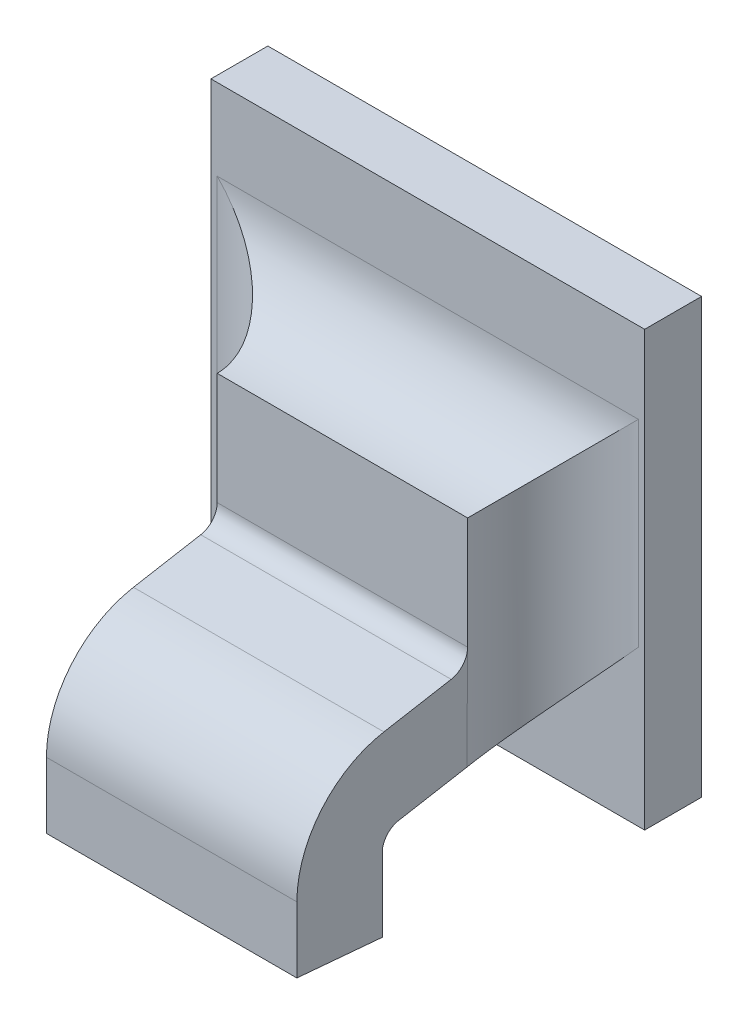
ISO-10303-21;
HEADER;
FILE_DESCRIPTION(('STEP AP214'),'2;1');
FILE_NAME('part.step','',(''),(''),'','','');
FILE_SCHEMA(('AUTOMOTIVE_DESIGN { 1 0 10303 214 1 1 1 1 }'));
ENDSEC;
DATA;
#1=APPLICATION_CONTEXT('core data for automotive mechanical design processes');
#2=APPLICATION_PROTOCOL_DEFINITION('international standard','automotive_design',2000,#1);
#3=PRODUCT_CONTEXT('',#1,'mechanical');
#4=PRODUCT('Part','Part','',(#3));
#5=PRODUCT_RELATED_PRODUCT_CATEGORY('part','',(#4));
#6=PRODUCT_DEFINITION_FORMATION('','',#4);
#7=PRODUCT_DEFINITION_CONTEXT('part definition',#1,'design');
#8=PRODUCT_DEFINITION('design','',#6,#7);
#9=PRODUCT_DEFINITION_SHAPE('','',#8);
#10=(LENGTH_UNIT() NAMED_UNIT(*) SI_UNIT(.MILLI.,.METRE.));
#11=(NAMED_UNIT(*) PLANE_ANGLE_UNIT() SI_UNIT($,.RADIAN.));
#12=(NAMED_UNIT(*) SI_UNIT($,.STERADIAN.) SOLID_ANGLE_UNIT());
#13=UNCERTAINTY_MEASURE_WITH_UNIT(LENGTH_MEASURE(1.E-05),#10,'distance_accuracy_value','');
#14=(GEOMETRIC_REPRESENTATION_CONTEXT(3) GLOBAL_UNCERTAINTY_ASSIGNED_CONTEXT((#13)) GLOBAL_UNIT_ASSIGNED_CONTEXT((#10,
#11,#12)) REPRESENTATION_CONTEXT('',''));
#15=CARTESIAN_POINT('',(0.,0.,0.));
#16=DIRECTION('',(0.,0.,1.));
#17=DIRECTION('',(1.,0.,0.));
#18=AXIS2_PLACEMENT_3D('',#15,#16,#17);
#19=CARTESIAN_POINT('',(0.128135864697779,-0.410007957948562,0.0757120583538573));
#20=DIRECTION('',(0.,0.984807753012208,0.17364817766693));
#21=DIRECTION('',(0.,-0.17364817766693,0.984807753012208));
#22=AXIS2_PLACEMENT_3D('',#19,#20,#21);
#23=PLANE('',#22);
#24=DIRECTION('',(0.,-0.1736481776669,0.984807753012213));
#25=VECTOR('',#24,1.);
#26=CARTESIAN_POINT('',(0.146324841075731,-0.410048986112752,0.0759447406355241));
#27=LINE('',#26,#25);
#28=CARTESIAN_POINT('',(0.146324841075731,-0.410048986112752,0.0759447406355241));
#29=VERTEX_POINT('',#28);
#30=CARTESIAN_POINT('',(0.146324841075731,-0.410869549396565,0.0805983862688596));
#31=VERTEX_POINT('',#30);
#32=EDGE_CURVE('E149',#29,#31,#27,.T.);
#33=ORIENTED_EDGE('',*,*,#32,.F.);
#34=DIRECTION('',(1.,0.,0.));
#35=VECTOR('',#34,1.);
#36=CARTESIAN_POINT('',(0.147190982808015,-0.410048986112752,0.075944740635524));
#37=LINE('',#36,#35);
#38=CARTESIAN_POINT('',(0.129002006430062,-0.410048986112752,0.0759447406355241));
#39=VERTEX_POINT('',#38);
#40=EDGE_CURVE('E145',#29,#39,#37,.F.);
#41=ORIENTED_EDGE('',*,*,#40,.T.);
#42=DIRECTION('',(0.,-0.1736481776669,0.984807753012213));
#43=VECTOR('',#42,1.);
#44=CARTESIAN_POINT('',(0.129002006430062,-0.410048986112752,0.0759447406355241));
#45=LINE('',#44,#43);
#46=CARTESIAN_POINT('',(0.129002006430062,-0.410869549396565,0.0805983862688596));
#47=VERTEX_POINT('',#46);
#48=EDGE_CURVE('E187',#39,#47,#45,.T.);
#49=ORIENTED_EDGE('',*,*,#48,.T.);
#50=DIRECTION('',(1.,0.,0.));
#51=VECTOR('',#50,1.);
#52=CARTESIAN_POINT('',(0.147190982808015,-0.410869549396566,0.0805983862688596));
#53=LINE('',#52,#51);
#54=EDGE_CURVE('E228',#31,#47,#53,.F.);
#55=ORIENTED_EDGE('',*,*,#54,.F.);
#56=EDGE_LOOP('',(#33,#41,#49,#55));
#57=FACE_BOUND('',#56,.T.);
#58=ADVANCED_FACE('F17',(#57),#23,.T.);
#59=CARTESIAN_POINT('',(0.147190982808015,-0.418042361770867,0.0793336259197108));
#60=DIRECTION('',(1.,0.,0.));
#61=DIRECTION('',(0.,1.,0.));
#62=AXIS2_PLACEMENT_3D('',#59,#60,#61);
#63=CYLINDRICAL_SURFACE('',#62,0.00728346456692914);
#64=CARTESIAN_POINT('',(0.146324841075731,-0.418042361770867,0.0793336259197108));
#65=DIRECTION('',(1.,0.,0.));
#66=DIRECTION('',(0.,1.,0.));
#67=AXIS2_PLACEMENT_3D('',#64,#65,#66);
#68=CIRCLE('',#67,0.00728346456692914);
#69=CARTESIAN_POINT('',(0.146324841075731,-0.418042361770867,0.0866170904866399));
#70=VERTEX_POINT('',#69);
#71=EDGE_CURVE('E202',#31,#70,#68,.T.);
#72=ORIENTED_EDGE('',*,*,#71,.F.);
#73=ORIENTED_EDGE('',*,*,#54,.T.);
#74=CARTESIAN_POINT('',(0.129002006430062,-0.418042361770867,0.0793336259197108));
#75=DIRECTION('',(1.,0.,0.));
#76=DIRECTION('',(0.,1.,0.));
#77=AXIS2_PLACEMENT_3D('',#74,#75,#76);
#78=CIRCLE('',#77,0.00728346456692914);
#79=CARTESIAN_POINT('',(0.129002006430062,-0.418042361770867,0.0866170904866399));
#80=VERTEX_POINT('',#79);
#81=EDGE_CURVE('E184',#47,#80,#78,.T.);
#82=ORIENTED_EDGE('',*,*,#81,.T.);
#83=DIRECTION('',(1.,0.,0.));
#84=VECTOR('',#83,1.);
#85=CARTESIAN_POINT('',(0.128135864697779,-0.418042361770867,0.0866170904866399));
#86=LINE('',#85,#84);
#87=EDGE_CURVE('E224',#70,#80,#86,.F.);
#88=ORIENTED_EDGE('',*,*,#87,.F.);
#89=EDGE_LOOP('',(#72,#73,#82,#88));
#90=FACE_BOUND('',#89,.T.);
#91=ADVANCED_FACE('F278',(#90),#63,.T.);
#92=CARTESIAN_POINT('',(0.128135864697779,-0.417814352243781,0.0866170904866399));
#93=DIRECTION('',(0.,0.,1.));
#94=DIRECTION('',(0.,-1.,0.));
#95=AXIS2_PLACEMENT_3D('',#92,#93,#94);
#96=PLANE('',#95);
#97=ORIENTED_EDGE('',*,*,#87,.T.);
#98=DIRECTION('',(0.,1.,0.));
#99=VECTOR('',#98,1.);
#100=CARTESIAN_POINT('',(0.129002006430062,-0.423840580153021,0.0866170904866399));
#101=LINE('',#100,#99);
#102=CARTESIAN_POINT('',(0.129002006430062,-0.422602552312591,0.0866170904866399));
#103=VERTEX_POINT('',#102);
#104=EDGE_CURVE('E181',#80,#103,#101,.F.);
#105=ORIENTED_EDGE('',*,*,#104,.T.);
#106=DIRECTION('',(1.,0.,0.));
#107=VECTOR('',#106,1.);
#108=CARTESIAN_POINT('',(0.137663423752897,-0.422602552312591,0.0866170904866399));
#109=LINE('',#108,#107);
#110=CARTESIAN_POINT('',(0.146324841075731,-0.422602552312591,0.0866170904866399));
#111=VERTEX_POINT('',#110);
#112=EDGE_CURVE('E215',#103,#111,#109,.T.);
#113=ORIENTED_EDGE('',*,*,#112,.T.);
#114=DIRECTION('',(0.,1.,0.));
#115=VECTOR('',#114,1.);
#116=CARTESIAN_POINT('',(0.146324841075731,-0.423840580153021,0.0866170904866399));
#117=LINE('',#116,#115);
#118=EDGE_CURVE('E200',#70,#111,#117,.F.);
#119=ORIENTED_EDGE('',*,*,#118,.F.);
#120=EDGE_LOOP('',(#97,#105,#113,#119));
#121=FACE_BOUND('',#120,.T.);
#122=ADVANCED_FACE('F282',(#121),#96,.T.);
#123=CARTESIAN_POINT('',(0.137663423752897,-0.422634640071055,0.0862503257291207));
#124=DIRECTION('',(0.,0.99619469809174,-0.0871557427477276));
#125=DIRECTION('',(0.,0.0871557427477276,0.99619469809174));
#126=AXIS2_PLACEMENT_3D('',#123,#124,#125);
#127=PLANE('',#126);
#128=DIRECTION('',(0.,-0.0871557427478353,-0.99619469809173));
#129=VECTOR('',#128,1.);
#130=CARTESIAN_POINT('',(0.146324841075731,-0.422602552312591,0.0866170904866399));
#131=LINE('',#130,#129);
#132=CARTESIAN_POINT('',(0.146324841075731,-0.423119217648375,0.0807115786756163));
#133=VERTEX_POINT('',#132);
#134=EDGE_CURVE('E197',#111,#133,#131,.T.);
#135=ORIENTED_EDGE('',*,*,#134,.F.);
#136=ORIENTED_EDGE('',*,*,#112,.F.);
#137=DIRECTION('',(0.,-0.0871557427478353,-0.99619469809173));
#138=VECTOR('',#137,1.);
#139=CARTESIAN_POINT('',(0.129002006430062,-0.422602552312591,0.0866170904866399));
#140=LINE('',#139,#138);
#141=CARTESIAN_POINT('',(0.129002006430062,-0.423119217648375,0.0807115786756163));
#142=VERTEX_POINT('',#141);
#143=EDGE_CURVE('E178',#103,#142,#140,.T.);
#144=ORIENTED_EDGE('',*,*,#143,.T.);
#145=DIRECTION('',(1.,0.,0.));
#146=VECTOR('',#145,1.);
#147=CARTESIAN_POINT('',(0.128135864697779,-0.423119217648375,0.0807115786756163));
#148=LINE('',#147,#146);
#149=EDGE_CURVE('E212',#142,#133,#148,.T.);
#150=ORIENTED_EDGE('',*,*,#149,.T.);
#151=EDGE_LOOP('',(#135,#136,#144,#150));
#152=FACE_BOUND('',#151,.T.);
#153=ADVANCED_FACE('F286',(#152),#127,.F.);
#154=CARTESIAN_POINT('',(0.128135864697779,-0.417788518976992,0.0807115786756163));
#155=DIRECTION('',(0.,0.,1.));
#156=DIRECTION('',(0.,-1.,0.));
#157=AXIS2_PLACEMENT_3D('',#154,#155,#156);
#158=PLANE('',#157);
#159=ORIENTED_EDGE('',*,*,#149,.F.);
#160=DIRECTION('',(0.,1.,0.));
#161=VECTOR('',#160,1.);
#162=CARTESIAN_POINT('',(0.129002006430062,-0.423840580153021,0.0807115786756163));
#163=LINE('',#162,#161);
#164=CARTESIAN_POINT('',(0.129002006430062,-0.418042361770867,0.0807115786756163));
#165=VERTEX_POINT('',#164);
#166=EDGE_CURVE('E175',#142,#165,#163,.T.);
#167=ORIENTED_EDGE('',*,*,#166,.T.);
#168=DIRECTION('',(1.,0.,0.));
#169=VECTOR('',#168,1.);
#170=CARTESIAN_POINT('',(0.147190982808015,-0.418042361770867,0.0807115786756163));
#171=LINE('',#170,#169);
#172=CARTESIAN_POINT('',(0.146324841075731,-0.418042361770867,0.0807115786756163));
#173=VERTEX_POINT('',#172);
#174=EDGE_CURVE('E207',#165,#173,#171,.T.);
#175=ORIENTED_EDGE('',*,*,#174,.T.);
#176=DIRECTION('',(0.,1.,0.));
#177=VECTOR('',#176,1.);
#178=CARTESIAN_POINT('',(0.146324841075731,-0.423840580153021,0.0807115786756163));
#179=LINE('',#178,#177);
#180=EDGE_CURVE('E194',#133,#173,#179,.T.);
#181=ORIENTED_EDGE('',*,*,#180,.F.);
#182=EDGE_LOOP('',(#159,#167,#175,#181));
#183=FACE_BOUND('',#182,.T.);
#184=ADVANCED_FACE('F290',(#183),#158,.F.);
#185=CARTESIAN_POINT('',(0.147190982808015,-0.418042361770867,0.0793336259197108));
#186=DIRECTION('',(1.,0.,0.));
#187=DIRECTION('',(0.,1.,0.));
#188=AXIS2_PLACEMENT_3D('',#185,#186,#187);
#189=CYLINDRICAL_SURFACE('',#188,0.00137795275590551);
#190=DIRECTION('',(1.,0.,0.));
#191=VECTOR('',#190,1.);
#192=CARTESIAN_POINT('',(0.128135864697779,-0.416685343213567,0.0795729049046849));
#193=LINE('',#192,#191);
#194=CARTESIAN_POINT('',(0.129002006430062,-0.416685343213567,0.079572904904685));
#195=VERTEX_POINT('',#194);
#196=CARTESIAN_POINT('',(0.146324841075731,-0.416685343213567,0.0795729049046849));
#197=VERTEX_POINT('',#196);
#198=EDGE_CURVE('E191',#195,#197,#193,.T.);
#199=ORIENTED_EDGE('',*,*,#198,.T.);
#200=CARTESIAN_POINT('',(0.146324841075731,-0.418042361770867,0.0793336259197108));
#201=DIRECTION('',(1.,0.,0.));
#202=DIRECTION('',(0.,1.,0.));
#203=AXIS2_PLACEMENT_3D('',#200,#201,#202);
#204=CIRCLE('',#203,0.00137795275590551);
#205=EDGE_CURVE('E196',#173,#197,#204,.F.);
#206=ORIENTED_EDGE('',*,*,#205,.F.);
#207=ORIENTED_EDGE('',*,*,#174,.F.);
#208=CARTESIAN_POINT('',(0.129002006430062,-0.418042361770867,0.0793336259197108));
#209=DIRECTION('',(1.,0.,0.));
#210=DIRECTION('',(0.,1.,0.));
#211=AXIS2_PLACEMENT_3D('',#208,#209,#210);
#212=CIRCLE('',#211,0.00137795275590551);
#213=EDGE_CURVE('E172',#165,#195,#212,.F.);
#214=ORIENTED_EDGE('',*,*,#213,.T.);
#215=EDGE_LOOP('',(#199,#206,#207,#214));
#216=FACE_BOUND('',#215,.T.);
#217=ADVANCED_FACE('F294',(#216),#189,.F.);
#218=CARTESIAN_POINT('',(0.147190982808015,-0.408691967555452,0.0761840196204982));
#219=DIRECTION('',(1.,0.,0.));
#220=DIRECTION('',(0.,1.,0.));
#221=AXIS2_PLACEMENT_3D('',#218,#219,#220);
#222=CYLINDRICAL_SURFACE('',#221,0.00137795275590552);
#223=ORIENTED_EDGE('',*,*,#40,.F.);
#224=CARTESIAN_POINT('',(0.146324841075731,-0.408691967555452,0.0761840196204982));
#225=DIRECTION('',(1.,0.,0.));
#226=DIRECTION('',(0.,1.,0.));
#227=AXIS2_PLACEMENT_3D('',#224,#225,#226);
#228=CIRCLE('',#227,0.00137795275590552);
#229=CARTESIAN_POINT('',(0.146324841075731,-0.408691967555452,0.0748060668645927));
#230=VERTEX_POINT('',#229);
#231=EDGE_CURVE('E20',#230,#29,#228,.F.);
#232=ORIENTED_EDGE('',*,*,#231,.F.);
#233=DIRECTION('',(1.,0.,0.));
#234=VECTOR('',#233,1.);
#235=CARTESIAN_POINT('',(0.128135864697779,-0.408691967555452,0.0748060668645927));
#236=LINE('',#235,#234);
#237=CARTESIAN_POINT('',(0.129002006430062,-0.408691967555452,0.0748060668645927));
#238=VERTEX_POINT('',#237);
#239=EDGE_CURVE('E127',#238,#230,#236,.T.);
#240=ORIENTED_EDGE('',*,*,#239,.F.);
#241=CARTESIAN_POINT('',(0.129002006430062,-0.408691967555452,0.0761840196204982));
#242=DIRECTION('',(1.,0.,0.));
#243=DIRECTION('',(0.,1.,0.));
#244=AXIS2_PLACEMENT_3D('',#241,#242,#243);
#245=CIRCLE('',#244,0.00137795275590552);
#246=EDGE_CURVE('E139',#238,#39,#245,.F.);
#247=ORIENTED_EDGE('',*,*,#246,.T.);
#248=EDGE_LOOP('',(#223,#232,#240,#247));
#249=FACE_BOUND('',#248,.T.);
#250=ADVANCED_FACE('F143',(#249),#222,.F.);
#251=CARTESIAN_POINT('',(0.146324841075731,-0.423840580153021,0.0742155156834903));
#252=DIRECTION('',(1.,0.,0.));
#253=DIRECTION('',(0.,1.,0.));
#254=AXIS2_PLACEMENT_3D('',#251,#252,#253);
#255=PLANE('',#254);
#256=ORIENTED_EDGE('',*,*,#205,.T.);
#257=DIRECTION('',(0.,-0.17364817766693,0.984807753012208));
#258=VECTOR('',#257,1.);
#259=CARTESIAN_POINT('',(0.146324841075731,-0.415823751765563,0.0746865769896825));
#260=LINE('',#259,#258);
#261=CARTESIAN_POINT('',(0.146324841075731,-0.415854338727757,0.0748626630679709));
#262=VERTEX_POINT('',#261);
#263=EDGE_CURVE('E162',#197,#262,#260,.F.);
#264=ORIENTED_EDGE('',*,*,#263,.T.);
#265=DIRECTION('',(0.,1.,0.));
#266=VECTOR('',#265,1.);
#267=CARTESIAN_POINT('',(0.146324841075731,-0.394003477177917,0.0748060668645927));
#268=LINE('',#267,#266);
#269=EDGE_CURVE('E138',#262,#230,#268,.T.);
#270=ORIENTED_EDGE('',*,*,#269,.T.);
#271=ORIENTED_EDGE('',*,*,#231,.T.);
#272=ORIENTED_EDGE('',*,*,#32,.T.);
#273=ORIENTED_EDGE('',*,*,#71,.T.);
#274=ORIENTED_EDGE('',*,*,#118,.T.);
#275=ORIENTED_EDGE('',*,*,#134,.T.);
#276=ORIENTED_EDGE('',*,*,#180,.T.);
#277=EDGE_LOOP('',(#256,#264,#270,#271,#272,#273,#274,#275,#276));
#278=FACE_BOUND('',#277,.T.);
#279=ADVANCED_FACE('F160',(#278),#255,.T.);
#280=CARTESIAN_POINT('',(0.128135864697779,-0.415823751765563,0.0746865769896825));
#281=DIRECTION('',(0.,0.984807753012208,0.17364817766693));
#282=DIRECTION('',(0.,-0.17364817766693,0.984807753012208));
#283=AXIS2_PLACEMENT_3D('',#280,#281,#282);
#284=PLANE('',#283);
#285=DIRECTION('',(1.,0.,0.));
#286=VECTOR('',#285,1.);
#287=CARTESIAN_POINT('',(0.153687045800141,-0.415864779929754,0.0749192592713492));
#288=LINE('',#287,#286);
#289=CARTESIAN_POINT('',(0.129002006430062,-0.415854338727757,0.074862663067971));
#290=VERTEX_POINT('',#289);
#291=EDGE_CURVE('E243',#262,#290,#288,.F.);
#292=ORIENTED_EDGE('',*,*,#291,.F.);
#293=ORIENTED_EDGE('',*,*,#263,.F.);
#294=ORIENTED_EDGE('',*,*,#198,.F.);
#295=DIRECTION('',(0.,0.173648177667089,-0.98480775301218));
#296=VECTOR('',#295,1.);
#297=CARTESIAN_POINT('',(0.129002006430062,-0.416685343213567,0.0795729049046849));
#298=LINE('',#297,#296);
#299=EDGE_CURVE('E169',#195,#290,#298,.T.);
#300=ORIENTED_EDGE('',*,*,#299,.T.);
#301=EDGE_LOOP('',(#292,#293,#294,#300));
#302=FACE_BOUND('',#301,.T.);
#303=ADVANCED_FACE('F297',(#302),#284,.F.);
#304=CARTESIAN_POINT('',(0.129002006430062,-0.423840580153021,0.0742155156834903));
#305=DIRECTION('',(1.,0.,0.));
#306=DIRECTION('',(0.,1.,0.));
#307=AXIS2_PLACEMENT_3D('',#304,#305,#306);
#308=PLANE('',#307);
#309=DIRECTION('',(0.,-1.,0.));
#310=VECTOR('',#309,1.);
#311=CARTESIAN_POINT('',(0.129002006430062,-0.450161607430702,0.0748060668645927));
#312=LINE('',#311,#310);
#313=EDGE_CURVE('E239',#238,#290,#312,.T.);
#314=ORIENTED_EDGE('',*,*,#313,.T.);
#315=ORIENTED_EDGE('',*,*,#299,.F.);
#316=ORIENTED_EDGE('',*,*,#213,.F.);
#317=ORIENTED_EDGE('',*,*,#166,.F.);
#318=ORIENTED_EDGE('',*,*,#143,.F.);
#319=ORIENTED_EDGE('',*,*,#104,.F.);
#320=ORIENTED_EDGE('',*,*,#81,.F.);
#321=ORIENTED_EDGE('',*,*,#48,.F.);
#322=ORIENTED_EDGE('',*,*,#246,.F.);
#323=EDGE_LOOP('',(#314,#315,#316,#317,#318,#319,#320,#321,#322));
#324=FACE_BOUND('',#323,.T.);
#325=ADVANCED_FACE('F300',(#324),#308,.F.);
#326=CARTESIAN_POINT('',(0.128135864697779,-0.400561861078007,0.0748060668645927));
#327=DIRECTION('',(0.,0.,1.));
#328=DIRECTION('',(0.,-1.,0.));
#329=AXIS2_PLACEMENT_3D('',#326,#327,#328);
#330=PLANE('',#329);
#331=DIRECTION('',(0.,1.,0.));
#332=VECTOR('',#331,1.);
#333=CARTESIAN_POINT('',(0.146324841075731,-0.394003477177917,0.0748060668645927));
#334=LINE('',#333,#332);
#335=CARTESIAN_POINT('',(0.146324841075731,-0.400949009005505,0.0748060668645927));
#336=VERTEX_POINT('',#335);
#337=EDGE_CURVE('E132',#230,#336,#334,.T.);
#338=ORIENTED_EDGE('',*,*,#337,.T.);
#339=DIRECTION('',(-1.,0.,0.));
#340=VECTOR('',#339,1.);
#341=CARTESIAN_POINT('',(0.121639801705653,-0.400949009005505,0.0748060668645927));
#342=LINE('',#341,#340);
#343=CARTESIAN_POINT('',(0.129002006430062,-0.400949009005505,0.0748060668645927));
#344=VERTEX_POINT('',#343);
#345=EDGE_CURVE('E237',#336,#344,#342,.T.);
#346=ORIENTED_EDGE('',*,*,#345,.T.);
#347=DIRECTION('',(0.,-1.,0.));
#348=VECTOR('',#347,1.);
#349=CARTESIAN_POINT('',(0.129002006430062,-0.450161607430702,0.0748060668645927));
#350=LINE('',#349,#348);
#351=EDGE_CURVE('E134',#344,#238,#350,.T.);
#352=ORIENTED_EDGE('',*,*,#351,.T.);
#353=ORIENTED_EDGE('',*,*,#239,.T.);
#354=EDGE_LOOP('',(#338,#346,#352,#353));
#355=FACE_BOUND('',#354,.T.);
#356=ADVANCED_FACE('F129',(#355),#330,.T.);
#357=CARTESIAN_POINT('',(0.152230352886755,-0.394003477177917,0.0748060668645927));
#358=DIRECTION('',(0.,1.,0.));
#359=DIRECTION('',(-1.,0.,0.));
#360=AXIS2_PLACEMENT_3D('',#357,#358,#359);
#361=CYLINDRICAL_SURFACE('',#360,0.00590551181102362);
#362=DIRECTION('',(0.,-1.,0.));
#363=VECTOR('',#362,1.);
#364=CARTESIAN_POINT('',(0.152230352886755,-0.387932960090704,0.068900555053569));
#365=LINE('',#364,#363);
#366=CARTESIAN_POINT('',(0.152230352886755,-0.395043497194481,0.068900555053569));
#367=VERTEX_POINT('',#366);
#368=CARTESIAN_POINT('',(0.152230352886755,-0.408691967555452,0.068900555053569));
#369=VERTEX_POINT('',#368);
#370=EDGE_CURVE('E236',#367,#369,#365,.T.);
#371=ORIENTED_EDGE('',*,*,#370,.F.);
#372=CARTESIAN_POINT('',(0.152230352886755,-0.395043497194481,0.0748060668645927));
#373=DIRECTION('',(-0.707106781186547,0.707106781186548,0.));
#374=DIRECTION('',(0.707106781186548,0.707106781186547,0.));
#375=AXIS2_PLACEMENT_3D('',#372,#373,#374);
#376=ELLIPSE('',#375,0.0083516548959041,0.00590551181102362);
#377=EDGE_CURVE('E156',#367,#336,#376,.T.);
#378=ORIENTED_EDGE('',*,*,#377,.T.);
#379=ORIENTED_EDGE('',*,*,#337,.F.);
#380=ORIENTED_EDGE('',*,*,#269,.F.);
#381=CARTESIAN_POINT('',(0.146325111854733,-0.415854561872961,0.0748626193057813));
#382=CARTESIAN_POINT('',(0.146321891055833,-0.415799677831006,0.0745625907676647));
#383=CARTESIAN_POINT('',(0.146342229175132,-0.415725244996855,0.0742670861215286));
#384=CARTESIAN_POINT('',(0.146423261788712,-0.41554336166514,0.0736951202756242));
#385=CARTESIAN_POINT('',(0.146483578279804,-0.415436225454875,0.0734185072209175));
#386=CARTESIAN_POINT('',(0.146637662656267,-0.415194303057861,0.0728895664132634));
#387=CARTESIAN_POINT('',(0.146731289385261,-0.415059634551697,0.0726371418024796));
#388=CARTESIAN_POINT('',(0.146945536979249,-0.414767735866421,0.0721575004164844));
#389=CARTESIAN_POINT('',(0.147066226739041,-0.414610448479235,0.0719303502308828));
#390=CARTESIAN_POINT('',(0.147396575450436,-0.41419249844069,0.0713921813150783));
#391=CARTESIAN_POINT('',(0.147619986030989,-0.413920409459733,0.0710984599177276));
#392=CARTESIAN_POINT('',(0.148099763186905,-0.413348994952561,0.0705703773106214));
#393=CARTESIAN_POINT('',(0.148356205846576,-0.413049607027618,0.0703361569747716));
#394=CARTESIAN_POINT('',(0.14899171270501,-0.412316737968483,0.069845986678206));
#395=CARTESIAN_POINT('',(0.149380632941185,-0.411875157343664,0.069614968129813));
#396=CARTESIAN_POINT('',(0.150180607245186,-0.410974132242906,0.069250281585139));
#397=CARTESIAN_POINT('',(0.15059164581106,-0.410514700339476,0.0691165463367525));
#398=CARTESIAN_POINT('',(0.151293029661886,-0.40973332706918,0.0689681308468835));
#399=CARTESIAN_POINT('',(0.151580803055979,-0.409413448990475,0.0689292677247087));
#400=CARTESIAN_POINT('',(0.151989512280873,-0.408959434551125,0.0689042416244373));
#401=CARTESIAN_POINT('',(0.152109939892567,-0.408825693308346,0.0689005652100869));
#402=CARTESIAN_POINT('',(0.152230352886755,-0.408691967555452,0.0689005550535691));
#403=B_SPLINE_CURVE_WITH_KNOTS('',3,(#381,#382,#383,#384,#385,#386,#387,#388,#389,#390,#391,
#392,#393,#394,#395,#396,#397,#398,#399,#400,#401,#402),.UNSPECIFIED.,.F.,.F.,(4,2,2,2,2,2,2,2,
2,2,4),(0.,0.000911854640629284,0.00181520821824953,0.00271477844400087,0.00361666525652746,
0.00498448467541978,0.0063555129614318,0.00824194679715822,0.0101270752955224,
0.0114210586750923,0.0119609297477213),.UNSPECIFIED.);
#404=EDGE_CURVE('E157',#369,#262,#403,.F.);
#405=ORIENTED_EDGE('',*,*,#404,.F.);
#406=EDGE_LOOP('',(#371,#378,#379,#380,#405));
#407=FACE_BOUND('',#406,.T.);
#408=ADVANCED_FACE('F153',(#407),#361,.F.);
#409=CARTESIAN_POINT('',(0.153687045800141,-0.408691967555452,0.0761840196204982));
#410=DIRECTION('',(1.,0.,0.));
#411=DIRECTION('',(0.,1.,0.));
#412=AXIS2_PLACEMENT_3D('',#409,#410,#411);
#413=CYLINDRICAL_SURFACE('',#412,0.00728346456692914);
#414=ORIENTED_EDGE('',*,*,#404,.T.);
#415=ORIENTED_EDGE('',*,*,#291,.T.);
#416=CARTESIAN_POINT('',(0.12900173565106,-0.415854561872961,0.0748626193057813));
#417=CARTESIAN_POINT('',(0.12900495644996,-0.415799677831006,0.0745625907676647));
#418=CARTESIAN_POINT('',(0.128984618330661,-0.415725244996855,0.0742670861215286));
#419=CARTESIAN_POINT('',(0.128903585717081,-0.415543361665139,0.0736951202756242));
#420=CARTESIAN_POINT('',(0.128843269225989,-0.415436225454875,0.0734185072209175));
#421=CARTESIAN_POINT('',(0.128689184849526,-0.415194303057861,0.0728895664132634));
#422=CARTESIAN_POINT('',(0.128595558120532,-0.415059634551697,0.0726371418024796));
#423=CARTESIAN_POINT('',(0.128381310526544,-0.414767735866421,0.0721575004164844));
#424=CARTESIAN_POINT('',(0.128260620766752,-0.414610448479234,0.0719303502308828));
#425=CARTESIAN_POINT('',(0.127930272055357,-0.41419249844069,0.0713921813150783));
#426=CARTESIAN_POINT('',(0.127706861474804,-0.413920409459733,0.0710984599177276));
#427=CARTESIAN_POINT('',(0.127227084318888,-0.413348994952561,0.0705703773106214));
#428=CARTESIAN_POINT('',(0.126970641659217,-0.413049607027618,0.0703361569747716));
#429=CARTESIAN_POINT('',(0.126335134800783,-0.412316737968483,0.069845986678206));
#430=CARTESIAN_POINT('',(0.125946214564608,-0.411875157343664,0.069614968129813));
#431=CARTESIAN_POINT('',(0.125146240260607,-0.410974132242906,0.069250281585139));
#432=CARTESIAN_POINT('',(0.124735201694733,-0.410514700339476,0.0691165463367525));
#433=CARTESIAN_POINT('',(0.124033817843906,-0.40973332706918,0.0689681308468836));
#434=CARTESIAN_POINT('',(0.123746044449813,-0.409413448990475,0.0689292677247087));
#435=CARTESIAN_POINT('',(0.12333733522492,-0.408959434551125,0.0689042416244373));
#436=CARTESIAN_POINT('',(0.123216907613226,-0.408825693308346,0.0689005652100869));
#437=CARTESIAN_POINT('',(0.123096494619038,-0.408691967555452,0.0689005550535691));
#438=B_SPLINE_CURVE_WITH_KNOTS('',3,(#416,#417,#418,#419,#420,#421,#422,#423,#424,#425,#426,
#427,#428,#429,#430,#431,#432,#433,#434,#435,#436,#437),.UNSPECIFIED.,.F.,.F.,(4,2,2,2,2,2,2,2,
2,2,4),(0.,0.000911854640629309,0.00181520821824953,0.0027147784440009,0.00361666525652749,
0.00498448467541979,0.0063555129614318,0.00824194679715817,0.0101270752955225,
0.0114210586750923,0.0119609297477213),.UNSPECIFIED.);
#439=CARTESIAN_POINT('',(0.123096494619038,-0.408691967555452,0.068900555053569));
#440=VERTEX_POINT('',#439);
#441=EDGE_CURVE('E240',#290,#440,#438,.T.);
#442=ORIENTED_EDGE('',*,*,#441,.T.);
#443=DIRECTION('',(1.,0.,0.));
#444=VECTOR('',#443,1.);
#445=CARTESIAN_POINT('',(0.121163423752896,-0.408691967555452,0.068900555053569));
#446=LINE('',#445,#444);
#447=EDGE_CURVE('E310',#369,#440,#446,.F.);
#448=ORIENTED_EDGE('',*,*,#447,.F.);
#449=EDGE_LOOP('',(#414,#415,#442,#448));
#450=FACE_BOUND('',#449,.T.);
#451=ADVANCED_FACE('F255',(#450),#413,.T.);
#452=CARTESIAN_POINT('',(0.123096494619038,-0.450161607430702,0.0748060668645927));
#453=DIRECTION('',(0.,-1.,0.));
#454=DIRECTION('',(1.,0.,0.));
#455=AXIS2_PLACEMENT_3D('',#452,#453,#454);
#456=CYLINDRICAL_SURFACE('',#455,0.00590551181102362);
#457=ORIENTED_EDGE('',*,*,#351,.F.);
#458=CARTESIAN_POINT('',(0.123096494619038,-0.395043497194481,0.0748060668645927));
#459=DIRECTION('',(-0.707106781186548,-0.707106781186547,0.));
#460=DIRECTION('',(0.707106781186547,-0.707106781186548,0.));
#461=AXIS2_PLACEMENT_3D('',#458,#459,#460);
#462=ELLIPSE('',#461,0.0083516548959041,0.00590551181102362);
#463=CARTESIAN_POINT('',(0.123096494619038,-0.395043497194481,0.068900555053569));
#464=VERTEX_POINT('',#463);
#465=EDGE_CURVE('E233',#344,#464,#462,.F.);
#466=ORIENTED_EDGE('',*,*,#465,.T.);
#467=DIRECTION('',(0.,-1.,0.));
#468=VECTOR('',#467,1.);
#469=CARTESIAN_POINT('',(0.123096494619038,-0.387932960090704,0.068900555053569));
#470=LINE('',#469,#468);
#471=EDGE_CURVE('E312',#440,#464,#470,.F.);
#472=ORIENTED_EDGE('',*,*,#471,.F.);
#473=ORIENTED_EDGE('',*,*,#441,.F.);
#474=ORIENTED_EDGE('',*,*,#313,.F.);
#475=EDGE_LOOP('',(#457,#466,#472,#473,#474));
#476=FACE_BOUND('',#475,.T.);
#477=ADVANCED_FACE('F252',(#476),#456,.F.);
#478=CARTESIAN_POINT('',(0.121639801705653,-0.395043497194481,0.0748060668645927));
#479=DIRECTION('',(-1.,0.,0.));
#480=DIRECTION('',(0.,-1.,0.));
#481=AXIS2_PLACEMENT_3D('',#478,#479,#480);
#482=CYLINDRICAL_SURFACE('',#481,0.00590551181102362);
#483=ORIENTED_EDGE('',*,*,#345,.F.);
#484=ORIENTED_EDGE('',*,*,#377,.F.);
#485=DIRECTION('',(1.,0.,0.));
#486=VECTOR('',#485,1.);
#487=CARTESIAN_POINT('',(0.121163423752896,-0.395043497194481,0.068900555053569));
#488=LINE('',#487,#486);
#489=EDGE_CURVE('E320',#464,#367,#488,.T.);
#490=ORIENTED_EDGE('',*,*,#489,.F.);
#491=ORIENTED_EDGE('',*,*,#465,.F.);
#492=EDGE_LOOP('',(#483,#484,#490,#491));
#493=FACE_BOUND('',#492,.T.);
#494=ADVANCED_FACE('F382',(#493),#482,.F.);
#495=CARTESIAN_POINT('',(0.121163423752896,-0.387932960090704,0.068900555053569));
#496=DIRECTION('',(0.,0.,1.));
#497=DIRECTION('',(0.,-1.,0.));
#498=AXIS2_PLACEMENT_3D('',#495,#496,#497);
#499=PLANE('',#498);
#500=ORIENTED_EDGE('',*,*,#471,.T.);
#501=ORIENTED_EDGE('',*,*,#489,.T.);
#502=ORIENTED_EDGE('',*,*,#370,.T.);
#503=ORIENTED_EDGE('',*,*,#447,.T.);
#504=EDGE_LOOP('',(#500,#501,#502,#503));
#505=FACE_BOUND('',#504,.T.);
#506=DIRECTION('',(0.,-1.,0.));
#507=VECTOR('',#506,1.);
#508=CARTESIAN_POINT('',(0.152663423752897,-0.387932960090704,0.068900555053569));
#509=LINE('',#508,#507);
#510=CARTESIAN_POINT('',(0.152663423752897,-0.419432960090704,0.068900555053569));
#511=VERTEX_POINT('',#510);
#512=CARTESIAN_POINT('',(0.152663423752897,-0.389432960090704,0.068900555053569));
#513=VERTEX_POINT('',#512);
#514=EDGE_CURVE('E332',#511,#513,#509,.F.);
#515=ORIENTED_EDGE('',*,*,#514,.T.);
#516=DIRECTION('',(1.,0.,0.));
#517=VECTOR('',#516,1.);
#518=CARTESIAN_POINT('',(0.121163423752896,-0.389432960090704,0.068900555053569));
#519=LINE('',#518,#517);
#520=CARTESIAN_POINT('',(0.122663423752897,-0.389432960090704,0.068900555053569));
#521=VERTEX_POINT('',#520);
#522=EDGE_CURVE('E337',#513,#521,#519,.F.);
#523=ORIENTED_EDGE('',*,*,#522,.T.);
#524=DIRECTION('',(0.,1.,0.));
#525=VECTOR('',#524,1.);
#526=CARTESIAN_POINT('',(0.122663423752897,-0.420932960090704,0.068900555053569));
#527=LINE('',#526,#525);
#528=CARTESIAN_POINT('',(0.122663423752897,-0.419432960090704,0.068900555053569));
#529=VERTEX_POINT('',#528);
#530=EDGE_CURVE('E340',#521,#529,#527,.F.);
#531=ORIENTED_EDGE('',*,*,#530,.T.);
#532=DIRECTION('',(-1.,0.,0.));
#533=VECTOR('',#532,1.);
#534=CARTESIAN_POINT('',(0.154163423752897,-0.419432960090704,0.068900555053569));
#535=LINE('',#534,#533);
#536=EDGE_CURVE('E324',#529,#511,#535,.F.);
#537=ORIENTED_EDGE('',*,*,#536,.T.);
#538=EDGE_LOOP('',(#515,#523,#531,#537));
#539=FACE_BOUND('',#538,.T.);
#540=ADVANCED_FACE('F317',(#505,#539),#499,.T.);
#541=CARTESIAN_POINT('',(0.154163423752897,-0.419432960090704,0.0647666967858525));
#542=DIRECTION('',(0.,1.,0.));
#543=DIRECTION('',(-1.,0.,0.));
#544=AXIS2_PLACEMENT_3D('',#541,#542,#543);
#545=PLANE('',#544);
#546=DIRECTION('',(0.,0.,1.));
#547=VECTOR('',#546,1.);
#548=CARTESIAN_POINT('',(0.152663423752897,-0.419432960090704,0.0647666967858525));
#549=LINE('',#548,#547);
#550=CARTESIAN_POINT('',(0.152663423752897,-0.419432960090704,0.0649635471795533));
#551=VERTEX_POINT('',#550);
#552=EDGE_CURVE('E325',#551,#511,#549,.T.);
#553=ORIENTED_EDGE('',*,*,#552,.T.);
#554=ORIENTED_EDGE('',*,*,#536,.F.);
#555=DIRECTION('',(0.,0.,1.));
#556=VECTOR('',#555,1.);
#557=CARTESIAN_POINT('',(0.122663423752897,-0.419432960090704,0.0647666967858525));
#558=LINE('',#557,#556);
#559=CARTESIAN_POINT('',(0.122663423752897,-0.419432960090704,0.0649635471795533));
#560=VERTEX_POINT('',#559);
#561=EDGE_CURVE('E343',#529,#560,#558,.F.);
#562=ORIENTED_EDGE('',*,*,#561,.T.);
#563=DIRECTION('',(1.,0.,0.));
#564=VECTOR('',#563,1.);
#565=CARTESIAN_POINT('',(0.121163423752896,-0.419432960090704,0.0649635471795533));
#566=LINE('',#565,#564);
#567=EDGE_CURVE('E346',#560,#551,#566,.T.);
#568=ORIENTED_EDGE('',*,*,#567,.T.);
#569=EDGE_LOOP('',(#553,#554,#562,#568));
#570=FACE_BOUND('',#569,.T.);
#571=ADVANCED_FACE('F364',(#570),#545,.F.);
#572=CARTESIAN_POINT('',(0.152663423752897,-0.387932960090704,0.0647666967858525));
#573=DIRECTION('',(-1.,0.,0.));
#574=DIRECTION('',(0.,-1.,0.));
#575=AXIS2_PLACEMENT_3D('',#572,#573,#574);
#576=PLANE('',#575);
#577=DIRECTION('',(0.,0.,1.));
#578=VECTOR('',#577,1.);
#579=CARTESIAN_POINT('',(0.152663423752897,-0.389432960090704,0.0647666967858525));
#580=LINE('',#579,#578);
#581=CARTESIAN_POINT('',(0.152663423752897,-0.389432960090704,0.0649635471795533));
#582=VERTEX_POINT('',#581);
#583=EDGE_CURVE('E334',#582,#513,#580,.T.);
#584=ORIENTED_EDGE('',*,*,#583,.T.);
#585=ORIENTED_EDGE('',*,*,#514,.F.);
#586=ORIENTED_EDGE('',*,*,#552,.F.);
#587=DIRECTION('',(0.,-1.,0.));
#588=VECTOR('',#587,1.);
#589=CARTESIAN_POINT('',(0.152663423752897,-0.387932960090704,0.0649635471795533));
#590=LINE('',#589,#588);
#591=EDGE_CURVE('E349',#551,#582,#590,.F.);
#592=ORIENTED_EDGE('',*,*,#591,.T.);
#593=EDGE_LOOP('',(#584,#585,#586,#592));
#594=FACE_BOUND('',#593,.T.);
#595=ADVANCED_FACE('F361',(#594),#576,.F.);
#596=CARTESIAN_POINT('',(0.121163423752896,-0.389432960090704,0.0647666967858525));
#597=DIRECTION('',(0.,-1.,0.));
#598=DIRECTION('',(1.,0.,0.));
#599=AXIS2_PLACEMENT_3D('',#596,#597,#598);
#600=PLANE('',#599);
#601=DIRECTION('',(0.,0.,1.));
#602=VECTOR('',#601,1.);
#603=CARTESIAN_POINT('',(0.122663423752897,-0.389432960090704,0.0647666967858525));
#604=LINE('',#603,#602);
#605=CARTESIAN_POINT('',(0.122663423752897,-0.389432960090704,0.0649635471795533));
#606=VERTEX_POINT('',#605);
#607=EDGE_CURVE('E34',#606,#521,#604,.T.);
#608=ORIENTED_EDGE('',*,*,#607,.T.);
#609=ORIENTED_EDGE('',*,*,#522,.F.);
#610=ORIENTED_EDGE('',*,*,#583,.F.);
#611=DIRECTION('',(1.,0.,0.));
#612=VECTOR('',#611,1.);
#613=CARTESIAN_POINT('',(0.121163423752896,-0.389432960090704,0.0649635471795533));
#614=LINE('',#613,#612);
#615=EDGE_CURVE('E26',#582,#606,#614,.F.);
#616=ORIENTED_EDGE('',*,*,#615,.T.);
#617=EDGE_LOOP('',(#608,#609,#610,#616));
#618=FACE_BOUND('',#617,.T.);
#619=ADVANCED_FACE('F355',(#618),#600,.F.);
#620=CARTESIAN_POINT('',(0.122663423752897,-0.420932960090704,0.0647666967858525));
#621=DIRECTION('',(1.,0.,0.));
#622=DIRECTION('',(0.,1.,0.));
#623=AXIS2_PLACEMENT_3D('',#620,#621,#622);
#624=PLANE('',#623);
#625=ORIENTED_EDGE('',*,*,#561,.F.);
#626=ORIENTED_EDGE('',*,*,#530,.F.);
#627=ORIENTED_EDGE('',*,*,#607,.F.);
#628=DIRECTION('',(0.,-1.,0.));
#629=VECTOR('',#628,1.);
#630=CARTESIAN_POINT('',(0.122663423752897,-0.387932960090704,0.0649635471795533));
#631=LINE('',#630,#629);
#632=EDGE_CURVE('E11',#606,#560,#631,.T.);
#633=ORIENTED_EDGE('',*,*,#632,.T.);
#634=EDGE_LOOP('',(#625,#626,#627,#633));
#635=FACE_BOUND('',#634,.T.);
#636=ADVANCED_FACE('F366',(#635),#624,.F.);
#637=CARTESIAN_POINT('',(0.121163423752896,-0.387932960090704,0.0649635471795533));
#638=DIRECTION('',(0.,0.,1.));
#639=DIRECTION('',(0.,-1.,0.));
#640=AXIS2_PLACEMENT_3D('',#637,#638,#639);
#641=PLANE('',#640);
#642=ORIENTED_EDGE('',*,*,#615,.F.);
#643=ORIENTED_EDGE('',*,*,#591,.F.);
#644=ORIENTED_EDGE('',*,*,#567,.F.);
#645=ORIENTED_EDGE('',*,*,#632,.F.);
#646=EDGE_LOOP('',(#642,#643,#644,#645));
#647=FACE_BOUND('',#646,.T.);
#648=ADVANCED_FACE('F359',(#647),#641,.F.);
#649=CLOSED_SHELL('',(#58,#91,#122,#153,#184,#217,#250,#279,#303,#325,#356,#408,#451,#477,#494,
#540,#571,#595,#619,#636,#648));
#650=MANIFOLD_SOLID_BREP('B1',#649);
#651=ADVANCED_BREP_SHAPE_REPRESENTATION('',(#18,#650),#14);
#652=SHAPE_DEFINITION_REPRESENTATION(#9,#651);
ENDSEC;
END-ISO-10303-21;
